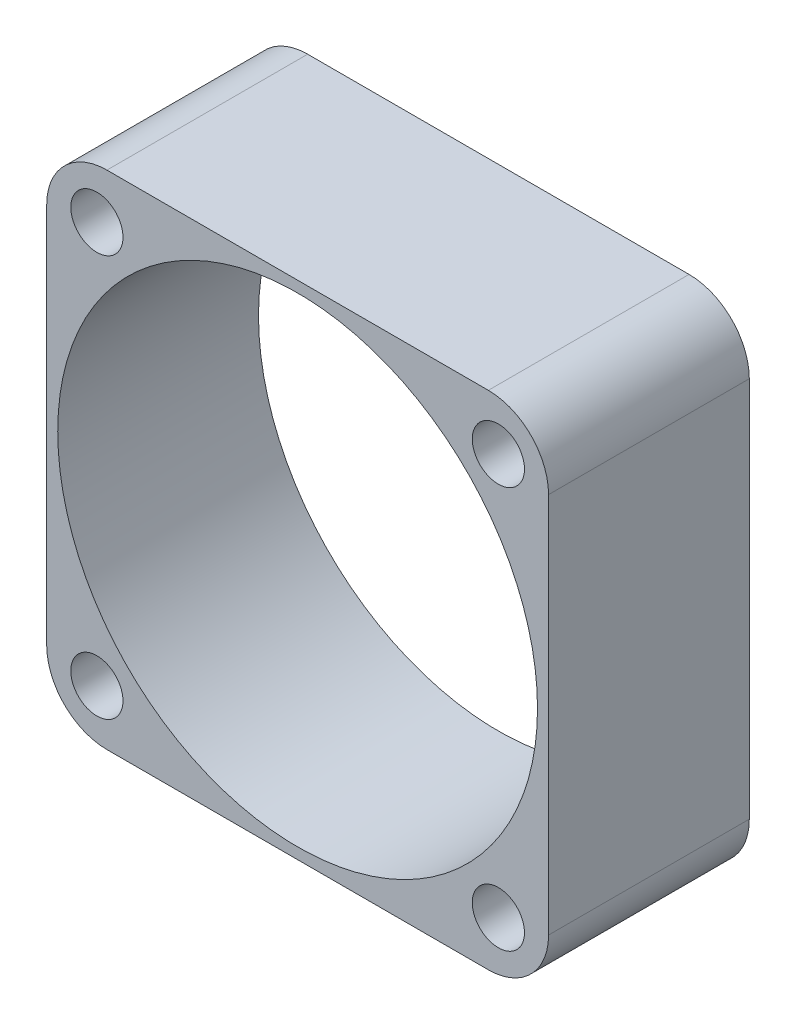
ISO-10303-21;
HEADER;
FILE_DESCRIPTION(('STEP AP214'),'2;1');
FILE_NAME('part.step','',(''),(''),'','','');
FILE_SCHEMA(('AUTOMOTIVE_DESIGN { 1 0 10303 214 1 1 1 1 }'));
ENDSEC;
DATA;
#1=APPLICATION_CONTEXT('core data for automotive mechanical design processes');
#2=APPLICATION_PROTOCOL_DEFINITION('international standard','automotive_design',2000,#1);
#3=PRODUCT_CONTEXT('',#1,'mechanical');
#4=PRODUCT('Part','Part','',(#3));
#5=PRODUCT_RELATED_PRODUCT_CATEGORY('part','',(#4));
#6=PRODUCT_DEFINITION_FORMATION('','',#4);
#7=PRODUCT_DEFINITION_CONTEXT('part definition',#1,'design');
#8=PRODUCT_DEFINITION('design','',#6,#7);
#9=PRODUCT_DEFINITION_SHAPE('','',#8);
#10=(LENGTH_UNIT() NAMED_UNIT(*) SI_UNIT(.MILLI.,.METRE.));
#11=(NAMED_UNIT(*) PLANE_ANGLE_UNIT() SI_UNIT($,.RADIAN.));
#12=(NAMED_UNIT(*) SI_UNIT($,.STERADIAN.) SOLID_ANGLE_UNIT());
#13=UNCERTAINTY_MEASURE_WITH_UNIT(LENGTH_MEASURE(1.E-05),#10,'distance_accuracy_value','');
#14=(GEOMETRIC_REPRESENTATION_CONTEXT(3) GLOBAL_UNCERTAINTY_ASSIGNED_CONTEXT((#13)) GLOBAL_UNIT_ASSIGNED_CONTEXT((#10,
#11,#12)) REPRESENTATION_CONTEXT('',''));
#15=CARTESIAN_POINT('',(0.,0.,0.));
#16=DIRECTION('',(0.,0.,1.));
#17=DIRECTION('',(1.,0.,0.));
#18=AXIS2_PLACEMENT_3D('',#15,#16,#17);
#19=CARTESIAN_POINT('',(-12.8241937913114,-87.6141399514316,10.));
#20=DIRECTION('',(-1.,0.,0.));
#21=DIRECTION('',(0.,0.,1.));
#22=AXIS2_PLACEMENT_3D('',#19,#20,#21);
#23=PLANE('',#22);
#24=DIRECTION('',(0.,1.,0.));
#25=VECTOR('',#24,1.);
#26=CARTESIAN_POINT('',(-12.8241937913114,-87.6141399514316,10.));
#27=LINE('',#26,#25);
#28=CARTESIAN_POINT('',(-12.8241937913114,-84.6141399514316,10.));
#29=VERTEX_POINT('',#28);
#30=CARTESIAN_POINT('',(-12.8241937913114,-65.6141399514316,10.));
#31=VERTEX_POINT('',#30);
#32=EDGE_CURVE('E119',#29,#31,#27,.T.);
#33=ORIENTED_EDGE('',*,*,#32,.F.);
#34=DIRECTION('',(0.,0.,-1.));
#35=VECTOR('',#34,1.);
#36=CARTESIAN_POINT('',(-12.8241937913114,-84.6141399514316,10.));
#37=LINE('',#36,#35);
#38=CARTESIAN_POINT('',(-12.8241937913114,-84.6141399514316,0.));
#39=VERTEX_POINT('',#38);
#40=EDGE_CURVE('E104',#29,#39,#37,.T.);
#41=ORIENTED_EDGE('',*,*,#40,.T.);
#42=DIRECTION('',(0.,1.,0.));
#43=VECTOR('',#42,1.);
#44=CARTESIAN_POINT('',(-12.8241937913114,-87.6141399514316,0.));
#45=LINE('',#44,#43);
#46=CARTESIAN_POINT('',(-12.8241937913114,-65.6141399514316,0.));
#47=VERTEX_POINT('',#46);
#48=EDGE_CURVE('E116',#39,#47,#45,.T.);
#49=ORIENTED_EDGE('',*,*,#48,.T.);
#50=DIRECTION('',(0.,0.,-1.));
#51=VECTOR('',#50,1.);
#52=CARTESIAN_POINT('',(-12.8241937913114,-65.6141399514316,10.));
#53=LINE('',#52,#51);
#54=EDGE_CURVE('E121',#47,#31,#53,.F.);
#55=ORIENTED_EDGE('',*,*,#54,.T.);
#56=EDGE_LOOP('',(#33,#41,#49,#55));
#57=FACE_BOUND('',#56,.T.);
#58=ADVANCED_FACE('F34',(#57),#23,.F.);
#59=CARTESIAN_POINT('',(-12.8241937913114,-62.6141399514316,10.));
#60=DIRECTION('',(0.,-1.,0.));
#61=DIRECTION('',(1.,0.,0.));
#62=AXIS2_PLACEMENT_3D('',#59,#60,#61);
#63=PLANE('',#62);
#64=DIRECTION('',(-1.,0.,0.));
#65=VECTOR('',#64,1.);
#66=CARTESIAN_POINT('',(-12.8241937913114,-62.6141399514316,10.));
#67=LINE('',#66,#65);
#68=CARTESIAN_POINT('',(-15.8241937913114,-62.6141399514316,10.));
#69=VERTEX_POINT('',#68);
#70=CARTESIAN_POINT('',(-34.8241937913114,-62.6141399514315,10.));
#71=VERTEX_POINT('',#70);
#72=EDGE_CURVE('E165',#69,#71,#67,.T.);
#73=ORIENTED_EDGE('',*,*,#72,.F.);
#74=DIRECTION('',(0.,0.,-1.));
#75=VECTOR('',#74,1.);
#76=CARTESIAN_POINT('',(-15.8241937913114,-62.6141399514316,10.));
#77=LINE('',#76,#75);
#78=CARTESIAN_POINT('',(-15.8241937913114,-62.6141399514316,0.));
#79=VERTEX_POINT('',#78);
#80=EDGE_CURVE('E158',#69,#79,#77,.T.);
#81=ORIENTED_EDGE('',*,*,#80,.T.);
#82=DIRECTION('',(-1.,0.,0.));
#83=VECTOR('',#82,1.);
#84=CARTESIAN_POINT('',(-12.8241937913114,-62.6141399514316,0.));
#85=LINE('',#84,#83);
#86=CARTESIAN_POINT('',(-34.8241937913114,-62.6141399514315,0.));
#87=VERTEX_POINT('',#86);
#88=EDGE_CURVE('E125',#79,#87,#85,.T.);
#89=ORIENTED_EDGE('',*,*,#88,.T.);
#90=DIRECTION('',(0.,0.,-1.));
#91=VECTOR('',#90,1.);
#92=CARTESIAN_POINT('',(-34.8241937913114,-62.6141399514315,10.));
#93=LINE('',#92,#91);
#94=EDGE_CURVE('E156',#87,#71,#93,.F.);
#95=ORIENTED_EDGE('',*,*,#94,.T.);
#96=EDGE_LOOP('',(#73,#81,#89,#95));
#97=FACE_BOUND('',#96,.T.);
#98=ADVANCED_FACE('F163',(#97),#63,.F.);
#99=CARTESIAN_POINT('',(-37.8241937913114,-87.6141399514316,10.));
#100=DIRECTION('',(1.,0.,0.));
#101=DIRECTION('',(0.,0.,-1.));
#102=AXIS2_PLACEMENT_3D('',#99,#100,#101);
#103=PLANE('',#102);
#104=DIRECTION('',(0.,-1.,0.));
#105=VECTOR('',#104,1.);
#106=CARTESIAN_POINT('',(-37.8241937913114,-87.6141399514316,10.));
#107=LINE('',#106,#105);
#108=CARTESIAN_POINT('',(-37.8241937913114,-65.6141399514315,10.));
#109=VERTEX_POINT('',#108);
#110=CARTESIAN_POINT('',(-37.8241937913114,-84.6141399514316,10.));
#111=VERTEX_POINT('',#110);
#112=EDGE_CURVE('E173',#109,#111,#107,.T.);
#113=ORIENTED_EDGE('',*,*,#112,.F.);
#114=DIRECTION('',(0.,0.,-1.));
#115=VECTOR('',#114,1.);
#116=CARTESIAN_POINT('',(-37.8241937913114,-65.6141399514315,10.));
#117=LINE('',#116,#115);
#118=CARTESIAN_POINT('',(-37.8241937913114,-65.6141399514315,0.));
#119=VERTEX_POINT('',#118);
#120=EDGE_CURVE('E11',#109,#119,#117,.T.);
#121=ORIENTED_EDGE('',*,*,#120,.T.);
#122=DIRECTION('',(0.,-1.,0.));
#123=VECTOR('',#122,1.);
#124=CARTESIAN_POINT('',(-37.8241937913114,-87.6141399514316,0.));
#125=LINE('',#124,#123);
#126=CARTESIAN_POINT('',(-37.8241937913114,-84.6141399514316,0.));
#127=VERTEX_POINT('',#126);
#128=EDGE_CURVE('E129',#119,#127,#125,.T.);
#129=ORIENTED_EDGE('',*,*,#128,.T.);
#130=DIRECTION('',(0.,0.,-1.));
#131=VECTOR('',#130,1.);
#132=CARTESIAN_POINT('',(-37.8241937913114,-84.6141399514316,10.));
#133=LINE('',#132,#131);
#134=EDGE_CURVE('E42',#127,#111,#133,.F.);
#135=ORIENTED_EDGE('',*,*,#134,.T.);
#136=EDGE_LOOP('',(#113,#121,#129,#135));
#137=FACE_BOUND('',#136,.T.);
#138=ADVANCED_FACE('F172',(#137),#103,.F.);
#139=CARTESIAN_POINT('',(-12.8241937913114,-87.6141399514316,10.));
#140=DIRECTION('',(0.,1.,0.));
#141=DIRECTION('',(0.,0.,1.));
#142=AXIS2_PLACEMENT_3D('',#139,#140,#141);
#143=PLANE('',#142);
#144=DIRECTION('',(1.,0.,0.));
#145=VECTOR('',#144,1.);
#146=CARTESIAN_POINT('',(-12.8241937913114,-87.6141399514316,0.));
#147=LINE('',#146,#145);
#148=CARTESIAN_POINT('',(-34.8241937913114,-87.6141399514316,0.));
#149=VERTEX_POINT('',#148);
#150=CARTESIAN_POINT('',(-15.8241937913114,-87.6141399514316,0.));
#151=VERTEX_POINT('',#150);
#152=EDGE_CURVE('E139',#149,#151,#147,.T.);
#153=ORIENTED_EDGE('',*,*,#152,.T.);
#154=DIRECTION('',(0.,0.,-1.));
#155=VECTOR('',#154,1.);
#156=CARTESIAN_POINT('',(-15.8241937913114,-87.6141399514316,10.));
#157=LINE('',#156,#155);
#158=CARTESIAN_POINT('',(-15.8241937913114,-87.6141399514316,10.));
#159=VERTEX_POINT('',#158);
#160=EDGE_CURVE('E105',#151,#159,#157,.F.);
#161=ORIENTED_EDGE('',*,*,#160,.T.);
#162=DIRECTION('',(1.,0.,0.));
#163=VECTOR('',#162,1.);
#164=CARTESIAN_POINT('',(-12.8241937913114,-87.6141399514316,10.));
#165=LINE('',#164,#163);
#166=CARTESIAN_POINT('',(-34.8241937913114,-87.6141399514316,10.));
#167=VERTEX_POINT('',#166);
#168=EDGE_CURVE('E135',#167,#159,#165,.T.);
#169=ORIENTED_EDGE('',*,*,#168,.F.);
#170=DIRECTION('',(0.,0.,-1.));
#171=VECTOR('',#170,1.);
#172=CARTESIAN_POINT('',(-34.8241937913114,-87.6141399514316,10.));
#173=LINE('',#172,#171);
#174=EDGE_CURVE('E110',#167,#149,#173,.T.);
#175=ORIENTED_EDGE('',*,*,#174,.T.);
#176=EDGE_LOOP('',(#153,#161,#169,#175));
#177=FACE_BOUND('',#176,.T.);
#178=ADVANCED_FACE('F218',(#177),#143,.F.);
#179=CARTESIAN_POINT('',(0.,0.,10.));
#180=DIRECTION('',(0.,0.,1.));
#181=DIRECTION('',(1.,0.,0.));
#182=AXIS2_PLACEMENT_3D('',#179,#180,#181);
#183=PLANE('',#182);
#184=CARTESIAN_POINT('',(-25.3241937913114,-75.1141399514315,10.));
#185=DIRECTION('',(0.,0.,1.));
#186=DIRECTION('',(1.,0.,0.));
#187=AXIS2_PLACEMENT_3D('',#184,#185,#186);
#188=CIRCLE('',#187,11.95);
#189=CARTESIAN_POINT('',(-13.3741937913114,-75.1141399514315,10.));
#190=VERTEX_POINT('',#189);
#191=EDGE_CURVE('E200',#190,#190,#188,.T.);
#192=ORIENTED_EDGE('',*,*,#191,.F.);
#193=EDGE_LOOP('',(#192));
#194=FACE_BOUND('',#193,.T.);
#195=CARTESIAN_POINT('',(-35.3241937913114,-85.1141399514316,10.));
#196=DIRECTION('',(0.,0.,1.));
#197=DIRECTION('',(1.,0.,0.));
#198=AXIS2_PLACEMENT_3D('',#195,#196,#197);
#199=CIRCLE('',#198,1.30000000000001);
#200=CARTESIAN_POINT('',(-34.0241937913114,-85.1141399514316,10.));
#201=VERTEX_POINT('',#200);
#202=EDGE_CURVE('E191',#201,#201,#199,.T.);
#203=ORIENTED_EDGE('',*,*,#202,.F.);
#204=EDGE_LOOP('',(#203));
#205=FACE_BOUND('',#204,.T.);
#206=CARTESIAN_POINT('',(-35.3241937913114,-65.1141399514315,10.));
#207=DIRECTION('',(0.,0.,1.));
#208=DIRECTION('',(1.,0.,0.));
#209=AXIS2_PLACEMENT_3D('',#206,#207,#208);
#210=CIRCLE('',#209,1.30000000000001);
#211=CARTESIAN_POINT('',(-34.0241937913114,-65.1141399514315,10.));
#212=VERTEX_POINT('',#211);
#213=EDGE_CURVE('E185',#212,#212,#210,.T.);
#214=ORIENTED_EDGE('',*,*,#213,.F.);
#215=EDGE_LOOP('',(#214));
#216=FACE_BOUND('',#215,.T.);
#217=CARTESIAN_POINT('',(-15.3241937913114,-65.1141399514315,10.));
#218=DIRECTION('',(0.,0.,1.));
#219=DIRECTION('',(1.,0.,0.));
#220=AXIS2_PLACEMENT_3D('',#217,#218,#219);
#221=CIRCLE('',#220,1.29999999999999);
#222=CARTESIAN_POINT('',(-14.0241937913114,-65.1141399514315,10.));
#223=VERTEX_POINT('',#222);
#224=EDGE_CURVE('E180',#223,#223,#221,.T.);
#225=ORIENTED_EDGE('',*,*,#224,.F.);
#226=EDGE_LOOP('',(#225));
#227=FACE_BOUND('',#226,.T.);
#228=CARTESIAN_POINT('',(-15.3241937913114,-85.1141399514316,10.));
#229=DIRECTION('',(0.,0.,1.));
#230=DIRECTION('',(1.,0.,0.));
#231=AXIS2_PLACEMENT_3D('',#228,#229,#230);
#232=CIRCLE('',#231,1.29999999999999);
#233=CARTESIAN_POINT('',(-14.0241937913114,-85.1141399514316,10.));
#234=VERTEX_POINT('',#233);
#235=EDGE_CURVE('E132',#234,#234,#232,.T.);
#236=ORIENTED_EDGE('',*,*,#235,.F.);
#237=EDGE_LOOP('',(#236));
#238=FACE_BOUND('',#237,.T.);
#239=ORIENTED_EDGE('',*,*,#168,.T.);
#240=CARTESIAN_POINT('',(-15.8241937913114,-84.6141399514316,10.));
#241=DIRECTION('',(0.,0.,1.));
#242=DIRECTION('',(1.,0.,0.));
#243=AXIS2_PLACEMENT_3D('',#240,#241,#242);
#244=CIRCLE('',#243,3.);
#245=EDGE_CURVE('E154',#159,#29,#244,.T.);
#246=ORIENTED_EDGE('',*,*,#245,.T.);
#247=ORIENTED_EDGE('',*,*,#32,.T.);
#248=CARTESIAN_POINT('',(-15.8241937913114,-65.6141399514316,10.));
#249=DIRECTION('',(0.,0.,1.));
#250=DIRECTION('',(1.,0.,0.));
#251=AXIS2_PLACEMENT_3D('',#248,#249,#250);
#252=CIRCLE('',#251,3.);
#253=EDGE_CURVE('E152',#31,#69,#252,.T.);
#254=ORIENTED_EDGE('',*,*,#253,.T.);
#255=ORIENTED_EDGE('',*,*,#72,.T.);
#256=CARTESIAN_POINT('',(-34.8241937913114,-65.6141399514315,10.));
#257=DIRECTION('',(0.,0.,1.));
#258=DIRECTION('',(1.,0.,0.));
#259=AXIS2_PLACEMENT_3D('',#256,#257,#258);
#260=CIRCLE('',#259,3.);
#261=EDGE_CURVE('E55',#71,#109,#260,.T.);
#262=ORIENTED_EDGE('',*,*,#261,.T.);
#263=ORIENTED_EDGE('',*,*,#112,.T.);
#264=CARTESIAN_POINT('',(-34.8241937913114,-84.6141399514316,10.));
#265=DIRECTION('',(0.,0.,1.));
#266=DIRECTION('',(1.,0.,0.));
#267=AXIS2_PLACEMENT_3D('',#264,#265,#266);
#268=CIRCLE('',#267,3.);
#269=EDGE_CURVE('E149',#111,#167,#268,.T.);
#270=ORIENTED_EDGE('',*,*,#269,.T.);
#271=EDGE_LOOP('',(#239,#246,#247,#254,#255,#262,#263,#270));
#272=FACE_BOUND('',#271,.T.);
#273=ADVANCED_FACE('F215',(#194,#205,#216,#227,#238,#272),#183,.T.);
#274=CARTESIAN_POINT('',(0.,0.,0.));
#275=DIRECTION('',(0.,0.,1.));
#276=DIRECTION('',(1.,0.,0.));
#277=AXIS2_PLACEMENT_3D('',#274,#275,#276);
#278=PLANE('',#277);
#279=CARTESIAN_POINT('',(-25.3241937913114,-75.1141399514315,0.));
#280=DIRECTION('',(0.,0.,1.));
#281=DIRECTION('',(1.,0.,0.));
#282=AXIS2_PLACEMENT_3D('',#279,#280,#281);
#283=CIRCLE('',#282,11.95);
#284=CARTESIAN_POINT('',(-13.3741937913114,-75.1141399514315,0.));
#285=VERTEX_POINT('',#284);
#286=EDGE_CURVE('E197',#285,#285,#283,.T.);
#287=ORIENTED_EDGE('',*,*,#286,.T.);
#288=EDGE_LOOP('',(#287));
#289=FACE_BOUND('',#288,.T.);
#290=CARTESIAN_POINT('',(-35.3241937913114,-85.1141399514316,0.));
#291=DIRECTION('',(0.,0.,1.));
#292=DIRECTION('',(1.,0.,0.));
#293=AXIS2_PLACEMENT_3D('',#290,#291,#292);
#294=CIRCLE('',#293,1.30000000000001);
#295=CARTESIAN_POINT('',(-34.0241937913114,-85.1141399514316,0.));
#296=VERTEX_POINT('',#295);
#297=EDGE_CURVE('E194',#296,#296,#294,.T.);
#298=ORIENTED_EDGE('',*,*,#297,.T.);
#299=EDGE_LOOP('',(#298));
#300=FACE_BOUND('',#299,.T.);
#301=CARTESIAN_POINT('',(-35.3241937913114,-65.1141399514315,0.));
#302=DIRECTION('',(0.,0.,1.));
#303=DIRECTION('',(1.,0.,0.));
#304=AXIS2_PLACEMENT_3D('',#301,#302,#303);
#305=CIRCLE('',#304,1.30000000000001);
#306=CARTESIAN_POINT('',(-34.0241937913114,-65.1141399514315,0.));
#307=VERTEX_POINT('',#306);
#308=EDGE_CURVE('E188',#307,#307,#305,.T.);
#309=ORIENTED_EDGE('',*,*,#308,.T.);
#310=EDGE_LOOP('',(#309));
#311=FACE_BOUND('',#310,.T.);
#312=CARTESIAN_POINT('',(-15.3241937913114,-65.1141399514315,0.));
#313=DIRECTION('',(0.,0.,1.));
#314=DIRECTION('',(1.,0.,0.));
#315=AXIS2_PLACEMENT_3D('',#312,#313,#314);
#316=CIRCLE('',#315,1.29999999999999);
#317=CARTESIAN_POINT('',(-14.0241937913114,-65.1141399514315,0.));
#318=VERTEX_POINT('',#317);
#319=EDGE_CURVE('E182',#318,#318,#316,.T.);
#320=ORIENTED_EDGE('',*,*,#319,.T.);
#321=EDGE_LOOP('',(#320));
#322=FACE_BOUND('',#321,.T.);
#323=CARTESIAN_POINT('',(-15.3241937913114,-85.1141399514316,0.));
#324=DIRECTION('',(0.,0.,1.));
#325=DIRECTION('',(1.,0.,0.));
#326=AXIS2_PLACEMENT_3D('',#323,#324,#325);
#327=CIRCLE('',#326,1.29999999999999);
#328=CARTESIAN_POINT('',(-14.0241937913114,-85.1141399514316,0.));
#329=VERTEX_POINT('',#328);
#330=EDGE_CURVE('E126',#329,#329,#327,.T.);
#331=ORIENTED_EDGE('',*,*,#330,.T.);
#332=EDGE_LOOP('',(#331));
#333=FACE_BOUND('',#332,.T.);
#334=ORIENTED_EDGE('',*,*,#48,.F.);
#335=CARTESIAN_POINT('',(-15.8241937913114,-84.6141399514316,0.));
#336=DIRECTION('',(0.,0.,1.));
#337=DIRECTION('',(1.,0.,0.));
#338=AXIS2_PLACEMENT_3D('',#335,#336,#337);
#339=CIRCLE('',#338,3.);
#340=EDGE_CURVE('E100',#39,#151,#339,.F.);
#341=ORIENTED_EDGE('',*,*,#340,.T.);
#342=ORIENTED_EDGE('',*,*,#152,.F.);
#343=CARTESIAN_POINT('',(-34.8241937913114,-84.6141399514316,0.));
#344=DIRECTION('',(0.,0.,1.));
#345=DIRECTION('',(1.,0.,0.));
#346=AXIS2_PLACEMENT_3D('',#343,#344,#345);
#347=CIRCLE('',#346,3.);
#348=EDGE_CURVE('E120',#149,#127,#347,.F.);
#349=ORIENTED_EDGE('',*,*,#348,.T.);
#350=ORIENTED_EDGE('',*,*,#128,.F.);
#351=CARTESIAN_POINT('',(-34.8241937913114,-65.6141399514315,0.));
#352=DIRECTION('',(0.,0.,1.));
#353=DIRECTION('',(1.,0.,0.));
#354=AXIS2_PLACEMENT_3D('',#351,#352,#353);
#355=CIRCLE('',#354,3.);
#356=EDGE_CURVE('E143',#119,#87,#355,.F.);
#357=ORIENTED_EDGE('',*,*,#356,.T.);
#358=ORIENTED_EDGE('',*,*,#88,.F.);
#359=CARTESIAN_POINT('',(-15.8241937913114,-65.6141399514316,0.));
#360=DIRECTION('',(0.,0.,1.));
#361=DIRECTION('',(1.,0.,0.));
#362=AXIS2_PLACEMENT_3D('',#359,#360,#361);
#363=CIRCLE('',#362,3.);
#364=EDGE_CURVE('E111',#79,#47,#363,.F.);
#365=ORIENTED_EDGE('',*,*,#364,.T.);
#366=EDGE_LOOP('',(#334,#341,#342,#349,#350,#357,#358,#365));
#367=FACE_BOUND('',#366,.T.);
#368=ADVANCED_FACE('F123',(#289,#300,#311,#322,#333,#367),#278,.F.);
#369=CARTESIAN_POINT('',(-15.8241937913114,-84.6141399514316,10.));
#370=DIRECTION('',(0.,0.,-1.));
#371=DIRECTION('',(-1.,0.,0.));
#372=AXIS2_PLACEMENT_3D('',#369,#370,#371);
#373=CYLINDRICAL_SURFACE('',#372,3.);
#374=ORIENTED_EDGE('',*,*,#245,.F.);
#375=ORIENTED_EDGE('',*,*,#160,.F.);
#376=ORIENTED_EDGE('',*,*,#340,.F.);
#377=ORIENTED_EDGE('',*,*,#40,.F.);
#378=EDGE_LOOP('',(#374,#375,#376,#377));
#379=FACE_BOUND('',#378,.T.);
#380=ADVANCED_FACE('F103',(#379),#373,.T.);
#381=CARTESIAN_POINT('',(-15.8241937913114,-65.6141399514316,10.));
#382=DIRECTION('',(0.,0.,-1.));
#383=DIRECTION('',(-1.,0.,0.));
#384=AXIS2_PLACEMENT_3D('',#381,#382,#383);
#385=CYLINDRICAL_SURFACE('',#384,3.);
#386=ORIENTED_EDGE('',*,*,#253,.F.);
#387=ORIENTED_EDGE('',*,*,#54,.F.);
#388=ORIENTED_EDGE('',*,*,#364,.F.);
#389=ORIENTED_EDGE('',*,*,#80,.F.);
#390=EDGE_LOOP('',(#386,#387,#388,#389));
#391=FACE_BOUND('',#390,.T.);
#392=ADVANCED_FACE('F240',(#391),#385,.T.);
#393=CARTESIAN_POINT('',(-34.8241937913114,-65.6141399514315,10.));
#394=DIRECTION('',(0.,0.,-1.));
#395=DIRECTION('',(-1.,0.,0.));
#396=AXIS2_PLACEMENT_3D('',#393,#394,#395);
#397=CYLINDRICAL_SURFACE('',#396,3.);
#398=ORIENTED_EDGE('',*,*,#261,.F.);
#399=ORIENTED_EDGE('',*,*,#94,.F.);
#400=ORIENTED_EDGE('',*,*,#356,.F.);
#401=ORIENTED_EDGE('',*,*,#120,.F.);
#402=EDGE_LOOP('',(#398,#399,#400,#401));
#403=FACE_BOUND('',#402,.T.);
#404=ADVANCED_FACE('F171',(#403),#397,.T.);
#405=CARTESIAN_POINT('',(-34.8241937913114,-84.6141399514316,10.));
#406=DIRECTION('',(0.,0.,-1.));
#407=DIRECTION('',(-1.,0.,0.));
#408=AXIS2_PLACEMENT_3D('',#405,#406,#407);
#409=CYLINDRICAL_SURFACE('',#408,3.);
#410=ORIENTED_EDGE('',*,*,#269,.F.);
#411=ORIENTED_EDGE('',*,*,#134,.F.);
#412=ORIENTED_EDGE('',*,*,#348,.F.);
#413=ORIENTED_EDGE('',*,*,#174,.F.);
#414=EDGE_LOOP('',(#410,#411,#412,#413));
#415=FACE_BOUND('',#414,.T.);
#416=ADVANCED_FACE('F36',(#415),#409,.T.);
#417=CARTESIAN_POINT('',(-15.3241937913114,-85.1141399514316,0.));
#418=DIRECTION('',(0.,0.,1.));
#419=DIRECTION('',(1.,0.,0.));
#420=AXIS2_PLACEMENT_3D('',#417,#418,#419);
#421=CYLINDRICAL_SURFACE('',#420,1.29999999999999);
#422=ORIENTED_EDGE('',*,*,#330,.F.);
#423=EDGE_LOOP('',(#422));
#424=FACE_BOUND('',#423,.T.);
#425=ORIENTED_EDGE('',*,*,#235,.T.);
#426=EDGE_LOOP('',(#425));
#427=FACE_BOUND('',#426,.T.);
#428=ADVANCED_FACE('F232',(#424,#427),#421,.F.);
#429=CARTESIAN_POINT('',(-15.3241937913114,-65.1141399514315,0.));
#430=DIRECTION('',(0.,0.,1.));
#431=DIRECTION('',(1.,0.,0.));
#432=AXIS2_PLACEMENT_3D('',#429,#430,#431);
#433=CYLINDRICAL_SURFACE('',#432,1.29999999999999);
#434=ORIENTED_EDGE('',*,*,#319,.F.);
#435=EDGE_LOOP('',(#434));
#436=FACE_BOUND('',#435,.T.);
#437=ORIENTED_EDGE('',*,*,#224,.T.);
#438=EDGE_LOOP('',(#437));
#439=FACE_BOUND('',#438,.T.);
#440=ADVANCED_FACE('F237',(#436,#439),#433,.F.);
#441=CARTESIAN_POINT('',(-35.3241937913114,-65.1141399514315,0.));
#442=DIRECTION('',(0.,0.,1.));
#443=DIRECTION('',(1.,0.,0.));
#444=AXIS2_PLACEMENT_3D('',#441,#442,#443);
#445=CYLINDRICAL_SURFACE('',#444,1.30000000000001);
#446=ORIENTED_EDGE('',*,*,#308,.F.);
#447=EDGE_LOOP('',(#446));
#448=FACE_BOUND('',#447,.T.);
#449=ORIENTED_EDGE('',*,*,#213,.T.);
#450=EDGE_LOOP('',(#449));
#451=FACE_BOUND('',#450,.T.);
#452=ADVANCED_FACE('F280',(#448,#451),#445,.F.);
#453=CARTESIAN_POINT('',(-35.3241937913114,-85.1141399514316,0.));
#454=DIRECTION('',(0.,0.,1.));
#455=DIRECTION('',(1.,0.,0.));
#456=AXIS2_PLACEMENT_3D('',#453,#454,#455);
#457=CYLINDRICAL_SURFACE('',#456,1.30000000000001);
#458=ORIENTED_EDGE('',*,*,#297,.F.);
#459=EDGE_LOOP('',(#458));
#460=FACE_BOUND('',#459,.T.);
#461=ORIENTED_EDGE('',*,*,#202,.T.);
#462=EDGE_LOOP('',(#461));
#463=FACE_BOUND('',#462,.T.);
#464=ADVANCED_FACE('F211',(#460,#463),#457,.F.);
#465=CARTESIAN_POINT('',(-25.3241937913114,-75.1141399514315,0.));
#466=DIRECTION('',(0.,0.,1.));
#467=DIRECTION('',(1.,0.,0.));
#468=AXIS2_PLACEMENT_3D('',#465,#466,#467);
#469=CYLINDRICAL_SURFACE('',#468,11.95);
#470=ORIENTED_EDGE('',*,*,#286,.F.);
#471=EDGE_LOOP('',(#470));
#472=FACE_BOUND('',#471,.T.);
#473=ORIENTED_EDGE('',*,*,#191,.T.);
#474=EDGE_LOOP('',(#473));
#475=FACE_BOUND('',#474,.T.);
#476=ADVANCED_FACE('F208',(#472,#475),#469,.F.);
#477=CLOSED_SHELL('',(#58,#98,#138,#178,#273,#368,#380,#392,#404,#416,#428,#440,#452,#464,#476));
#478=MANIFOLD_SOLID_BREP('B2',#477);
#479=ADVANCED_BREP_SHAPE_REPRESENTATION('',(#18,#478),#14);
#480=SHAPE_DEFINITION_REPRESENTATION(#9,#479);
ENDSEC;
END-ISO-10303-21;
